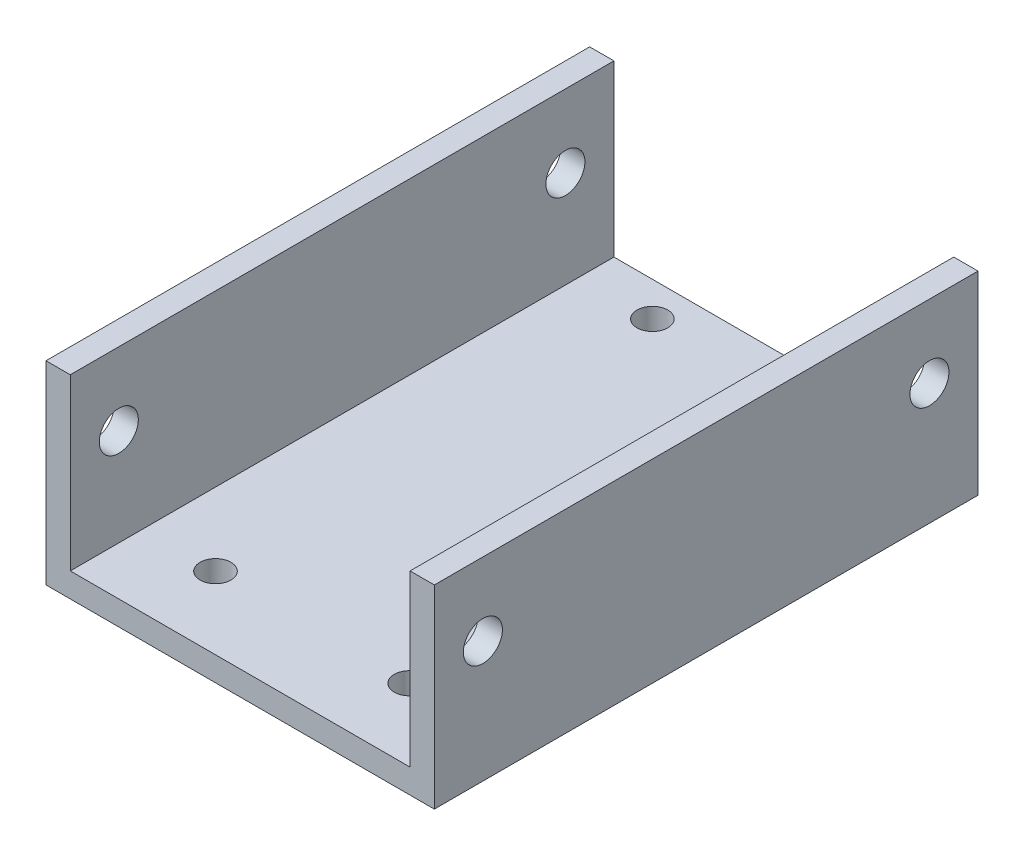
ISO-10303-21;
HEADER;
FILE_DESCRIPTION(('STEP AP214'),'2;1');
FILE_NAME('part.step','',(''),(''),'','','');
FILE_SCHEMA(('AUTOMOTIVE_DESIGN { 1 0 10303 214 1 1 1 1 }'));
ENDSEC;
DATA;
#1=APPLICATION_CONTEXT('core data for automotive mechanical design processes');
#2=APPLICATION_PROTOCOL_DEFINITION('international standard','automotive_design',2000,#1);
#3=PRODUCT_CONTEXT('',#1,'mechanical');
#4=PRODUCT('Part','Part','',(#3));
#5=PRODUCT_RELATED_PRODUCT_CATEGORY('part','',(#4));
#6=PRODUCT_DEFINITION_FORMATION('','',#4);
#7=PRODUCT_DEFINITION_CONTEXT('part definition',#1,'design');
#8=PRODUCT_DEFINITION('design','',#6,#7);
#9=PRODUCT_DEFINITION_SHAPE('','',#8);
#10=(LENGTH_UNIT() NAMED_UNIT(*) SI_UNIT(.MILLI.,.METRE.));
#11=(NAMED_UNIT(*) PLANE_ANGLE_UNIT() SI_UNIT($,.RADIAN.));
#12=(NAMED_UNIT(*) SI_UNIT($,.STERADIAN.) SOLID_ANGLE_UNIT());
#13=UNCERTAINTY_MEASURE_WITH_UNIT(LENGTH_MEASURE(1.E-05),#10,'distance_accuracy_value','');
#14=(GEOMETRIC_REPRESENTATION_CONTEXT(3) GLOBAL_UNCERTAINTY_ASSIGNED_CONTEXT((#13)) GLOBAL_UNIT_ASSIGNED_CONTEXT((#10,
#11,#12)) REPRESENTATION_CONTEXT('',''));
#15=CARTESIAN_POINT('',(0.,0.,0.));
#16=DIRECTION('',(0.,0.,1.));
#17=DIRECTION('',(1.,0.,0.));
#18=AXIS2_PLACEMENT_3D('',#15,#16,#17);
#19=CARTESIAN_POINT('',(0.,0.,71.12));
#20=DIRECTION('',(1.,0.,0.));
#21=DIRECTION('',(0.,0.,-1.));
#22=AXIS2_PLACEMENT_3D('',#19,#20,#21);
#23=PLANE('',#22);
#24=CARTESIAN_POINT('',(0.,15.8750000000002,6.35000000000003));
#25=DIRECTION('',(1.,0.,0.));
#26=DIRECTION('',(0.,0.,-1.));
#27=AXIS2_PLACEMENT_3D('',#24,#25,#26);
#28=CIRCLE('',#27,2.5527);
#29=CARTESIAN_POINT('',(0.,15.8750000000002,3.79730000000003));
#30=VERTEX_POINT('',#29);
#31=EDGE_CURVE('E165',#30,#30,#28,.T.);
#32=ORIENTED_EDGE('',*,*,#31,.T.);
#33=EDGE_LOOP('',(#32));
#34=FACE_BOUND('',#33,.T.);
#35=CARTESIAN_POINT('',(0.,15.8750000000001,64.77));
#36=DIRECTION('',(1.,0.,0.));
#37=DIRECTION('',(0.,0.,-1.));
#38=AXIS2_PLACEMENT_3D('',#35,#36,#37);
#39=CIRCLE('',#38,2.55270000000001);
#40=CARTESIAN_POINT('',(0.,15.8750000000001,62.2173));
#41=VERTEX_POINT('',#40);
#42=EDGE_CURVE('E176',#41,#41,#39,.T.);
#43=ORIENTED_EDGE('',*,*,#42,.T.);
#44=EDGE_LOOP('',(#43));
#45=FACE_BOUND('',#44,.T.);
#46=DIRECTION('',(0.,-1.,0.));
#47=VECTOR('',#46,1.);
#48=CARTESIAN_POINT('',(0.,0.,0.));
#49=LINE('',#48,#47);
#50=CARTESIAN_POINT('',(0.,25.4,0.));
#51=VERTEX_POINT('',#50);
#52=CARTESIAN_POINT('',(0.,0.,0.));
#53=VERTEX_POINT('',#52);
#54=EDGE_CURVE('E136',#51,#53,#49,.T.);
#55=ORIENTED_EDGE('',*,*,#54,.T.);
#56=DIRECTION('',(0.,0.,-1.));
#57=VECTOR('',#56,1.);
#58=CARTESIAN_POINT('',(0.,0.,71.12));
#59=LINE('',#58,#57);
#60=CARTESIAN_POINT('',(0.,0.,71.12));
#61=VERTEX_POINT('',#60);
#62=EDGE_CURVE('E11',#61,#53,#59,.T.);
#63=ORIENTED_EDGE('',*,*,#62,.F.);
#64=DIRECTION('',(0.,-1.,0.));
#65=VECTOR('',#64,1.);
#66=CARTESIAN_POINT('',(0.,0.,71.12));
#67=LINE('',#66,#65);
#68=CARTESIAN_POINT('',(0.,25.4,71.12));
#69=VERTEX_POINT('',#68);
#70=EDGE_CURVE('E151',#69,#61,#67,.T.);
#71=ORIENTED_EDGE('',*,*,#70,.F.);
#72=DIRECTION('',(0.,0.,-1.));
#73=VECTOR('',#72,1.);
#74=CARTESIAN_POINT('',(0.,25.4,71.12));
#75=LINE('',#74,#73);
#76=EDGE_CURVE('E132',#69,#51,#75,.T.);
#77=ORIENTED_EDGE('',*,*,#76,.T.);
#78=EDGE_LOOP('',(#55,#63,#71,#77));
#79=FACE_BOUND('',#78,.T.);
#80=ADVANCED_FACE('F38',(#34,#45,#79),#23,.F.);
#81=CARTESIAN_POINT('',(0.,0.,71.12));
#82=DIRECTION('',(0.,1.,0.));
#83=DIRECTION('',(0.,0.,1.));
#84=AXIS2_PLACEMENT_3D('',#81,#82,#83);
#85=PLANE('',#84);
#86=CARTESIAN_POINT('',(38.1,0.,61.6475));
#87=DIRECTION('',(0.,1.,0.));
#88=DIRECTION('',(0.,0.,1.));
#89=AXIS2_PLACEMENT_3D('',#86,#87,#88);
#90=CIRCLE('',#89,2.01929999999999);
#91=CARTESIAN_POINT('',(38.1,0.,63.6668));
#92=VERTEX_POINT('',#91);
#93=EDGE_CURVE('E197',#92,#92,#90,.F.);
#94=ORIENTED_EDGE('',*,*,#93,.F.);
#95=EDGE_LOOP('',(#94));
#96=FACE_BOUND('',#95,.T.);
#97=CARTESIAN_POINT('',(12.7,0.,4.49749999999999));
#98=DIRECTION('',(0.,1.,0.));
#99=DIRECTION('',(0.,0.,1.));
#100=AXIS2_PLACEMENT_3D('',#97,#98,#99);
#101=CIRCLE('',#100,2.01929999999999);
#102=CARTESIAN_POINT('',(12.7,0.,6.51679999999999));
#103=VERTEX_POINT('',#102);
#104=EDGE_CURVE('E198',#103,#103,#101,.F.);
#105=ORIENTED_EDGE('',*,*,#104,.F.);
#106=EDGE_LOOP('',(#105));
#107=FACE_BOUND('',#106,.T.);
#108=CARTESIAN_POINT('',(12.7,0.,61.6475));
#109=DIRECTION('',(0.,1.,0.));
#110=DIRECTION('',(0.,0.,1.));
#111=AXIS2_PLACEMENT_3D('',#108,#109,#110);
#112=CIRCLE('',#111,2.01929999999999);
#113=CARTESIAN_POINT('',(12.7,0.,63.6668));
#114=VERTEX_POINT('',#113);
#115=EDGE_CURVE('E190',#114,#114,#112,.F.);
#116=ORIENTED_EDGE('',*,*,#115,.F.);
#117=EDGE_LOOP('',(#116));
#118=FACE_BOUND('',#117,.T.);
#119=CARTESIAN_POINT('',(38.1,0.,4.49749999999999));
#120=DIRECTION('',(0.,1.,0.));
#121=DIRECTION('',(0.,0.,1.));
#122=AXIS2_PLACEMENT_3D('',#119,#120,#121);
#123=CIRCLE('',#122,2.0193);
#124=CARTESIAN_POINT('',(38.1,0.,6.51679999999999));
#125=VERTEX_POINT('',#124);
#126=EDGE_CURVE('E140',#125,#125,#123,.F.);
#127=ORIENTED_EDGE('',*,*,#126,.F.);
#128=EDGE_LOOP('',(#127));
#129=FACE_BOUND('',#128,.T.);
#130=DIRECTION('',(1.,0.,0.));
#131=VECTOR('',#130,1.);
#132=CARTESIAN_POINT('',(0.,0.,0.));
#133=LINE('',#132,#131);
#134=CARTESIAN_POINT('',(50.8,0.,0.));
#135=VERTEX_POINT('',#134);
#136=EDGE_CURVE('E139',#53,#135,#133,.T.);
#137=ORIENTED_EDGE('',*,*,#136,.T.);
#138=DIRECTION('',(0.,0.,-1.));
#139=VECTOR('',#138,1.);
#140=CARTESIAN_POINT('',(50.8,0.,71.12));
#141=LINE('',#140,#139);
#142=CARTESIAN_POINT('',(50.8,0.,71.12));
#143=VERTEX_POINT('',#142);
#144=EDGE_CURVE('E47',#143,#135,#141,.T.);
#145=ORIENTED_EDGE('',*,*,#144,.F.);
#146=DIRECTION('',(1.,0.,0.));
#147=VECTOR('',#146,1.);
#148=CARTESIAN_POINT('',(0.,0.,71.12));
#149=LINE('',#148,#147);
#150=EDGE_CURVE('E99',#61,#143,#149,.T.);
#151=ORIENTED_EDGE('',*,*,#150,.F.);
#152=ORIENTED_EDGE('',*,*,#62,.T.);
#153=EDGE_LOOP('',(#137,#145,#151,#152));
#154=FACE_BOUND('',#153,.T.);
#155=ADVANCED_FACE('F244',(#96,#107,#118,#129,#154),#85,.F.);
#156=CARTESIAN_POINT('',(50.8,0.,71.12));
#157=DIRECTION('',(-1.,0.,0.));
#158=DIRECTION('',(0.,0.,1.));
#159=AXIS2_PLACEMENT_3D('',#156,#157,#158);
#160=PLANE('',#159);
#161=CARTESIAN_POINT('',(50.8,15.8750000000002,6.35000000000003));
#162=DIRECTION('',(1.,0.,0.));
#163=DIRECTION('',(0.,0.,-1.));
#164=AXIS2_PLACEMENT_3D('',#161,#162,#163);
#165=CIRCLE('',#164,2.5527);
#166=CARTESIAN_POINT('',(50.8,15.8750000000002,3.79730000000003));
#167=VERTEX_POINT('',#166);
#168=EDGE_CURVE('E171',#167,#167,#165,.T.);
#169=ORIENTED_EDGE('',*,*,#168,.F.);
#170=EDGE_LOOP('',(#169));
#171=FACE_BOUND('',#170,.T.);
#172=CARTESIAN_POINT('',(50.8,15.8750000000001,64.77));
#173=DIRECTION('',(1.,0.,0.));
#174=DIRECTION('',(0.,0.,-1.));
#175=AXIS2_PLACEMENT_3D('',#172,#173,#174);
#176=CIRCLE('',#175,2.55270000000001);
#177=CARTESIAN_POINT('',(50.8,15.8750000000001,62.2173));
#178=VERTEX_POINT('',#177);
#179=EDGE_CURVE('E181',#178,#178,#176,.T.);
#180=ORIENTED_EDGE('',*,*,#179,.F.);
#181=EDGE_LOOP('',(#180));
#182=FACE_BOUND('',#181,.T.);
#183=DIRECTION('',(0.,1.,0.));
#184=VECTOR('',#183,1.);
#185=CARTESIAN_POINT('',(50.8,0.,0.));
#186=LINE('',#185,#184);
#187=CARTESIAN_POINT('',(50.8,25.4,0.));
#188=VERTEX_POINT('',#187);
#189=EDGE_CURVE('E142',#135,#188,#186,.T.);
#190=ORIENTED_EDGE('',*,*,#189,.T.);
#191=DIRECTION('',(0.,0.,-1.));
#192=VECTOR('',#191,1.);
#193=CARTESIAN_POINT('',(50.8,25.4,71.12));
#194=LINE('',#193,#192);
#195=CARTESIAN_POINT('',(50.8,25.4,71.12));
#196=VERTEX_POINT('',#195);
#197=EDGE_CURVE('E158',#196,#188,#194,.T.);
#198=ORIENTED_EDGE('',*,*,#197,.F.);
#199=DIRECTION('',(0.,1.,0.));
#200=VECTOR('',#199,1.);
#201=CARTESIAN_POINT('',(50.8,0.,71.12));
#202=LINE('',#201,#200);
#203=EDGE_CURVE('E212',#143,#196,#202,.T.);
#204=ORIENTED_EDGE('',*,*,#203,.F.);
#205=ORIENTED_EDGE('',*,*,#144,.T.);
#206=EDGE_LOOP('',(#190,#198,#204,#205));
#207=FACE_BOUND('',#206,.T.);
#208=ADVANCED_FACE('F248',(#171,#182,#207),#160,.F.);
#209=CARTESIAN_POINT('',(50.8,25.4,71.12));
#210=DIRECTION('',(0.,-1.,0.));
#211=DIRECTION('',(0.,0.,-1.));
#212=AXIS2_PLACEMENT_3D('',#209,#210,#211);
#213=PLANE('',#212);
#214=DIRECTION('',(-1.,0.,0.));
#215=VECTOR('',#214,1.);
#216=CARTESIAN_POINT('',(50.8,25.4,0.));
#217=LINE('',#216,#215);
#218=CARTESIAN_POINT('',(47.625,25.4,0.));
#219=VERTEX_POINT('',#218);
#220=EDGE_CURVE('E144',#188,#219,#217,.T.);
#221=ORIENTED_EDGE('',*,*,#220,.T.);
#222=DIRECTION('',(0.,0.,-1.));
#223=VECTOR('',#222,1.);
#224=CARTESIAN_POINT('',(47.625,25.4,71.12));
#225=LINE('',#224,#223);
#226=CARTESIAN_POINT('',(47.625,25.4,71.12));
#227=VERTEX_POINT('',#226);
#228=EDGE_CURVE('E155',#227,#219,#225,.T.);
#229=ORIENTED_EDGE('',*,*,#228,.F.);
#230=DIRECTION('',(-1.,0.,0.));
#231=VECTOR('',#230,1.);
#232=CARTESIAN_POINT('',(50.8,25.4,71.12));
#233=LINE('',#232,#231);
#234=EDGE_CURVE('E214',#196,#227,#233,.T.);
#235=ORIENTED_EDGE('',*,*,#234,.F.);
#236=ORIENTED_EDGE('',*,*,#197,.T.);
#237=EDGE_LOOP('',(#221,#229,#235,#236));
#238=FACE_BOUND('',#237,.T.);
#239=ADVANCED_FACE('F220',(#238),#213,.F.);
#240=CARTESIAN_POINT('',(47.625,3.175,71.12));
#241=DIRECTION('',(1.,0.,0.));
#242=DIRECTION('',(0.,0.,-1.));
#243=AXIS2_PLACEMENT_3D('',#240,#241,#242);
#244=PLANE('',#243);
#245=CARTESIAN_POINT('',(47.625,15.8750000000002,6.35000000000003));
#246=DIRECTION('',(1.,0.,0.));
#247=DIRECTION('',(0.,0.,-1.));
#248=AXIS2_PLACEMENT_3D('',#245,#246,#247);
#249=CIRCLE('',#248,2.5527);
#250=CARTESIAN_POINT('',(47.625,15.8750000000002,3.79730000000003));
#251=VERTEX_POINT('',#250);
#252=EDGE_CURVE('E184',#251,#251,#249,.T.);
#253=ORIENTED_EDGE('',*,*,#252,.T.);
#254=EDGE_LOOP('',(#253));
#255=FACE_BOUND('',#254,.T.);
#256=CARTESIAN_POINT('',(47.625,15.8750000000001,64.77));
#257=DIRECTION('',(1.,0.,0.));
#258=DIRECTION('',(0.,0.,-1.));
#259=AXIS2_PLACEMENT_3D('',#256,#257,#258);
#260=CIRCLE('',#259,2.55270000000001);
#261=CARTESIAN_POINT('',(47.625,15.8750000000001,62.2173));
#262=VERTEX_POINT('',#261);
#263=EDGE_CURVE('E164',#262,#262,#260,.T.);
#264=ORIENTED_EDGE('',*,*,#263,.T.);
#265=EDGE_LOOP('',(#264));
#266=FACE_BOUND('',#265,.T.);
#267=DIRECTION('',(0.,-1.,0.));
#268=VECTOR('',#267,1.);
#269=CARTESIAN_POINT('',(47.625,3.175,0.));
#270=LINE('',#269,#268);
#271=CARTESIAN_POINT('',(47.625,3.175,0.));
#272=VERTEX_POINT('',#271);
#273=EDGE_CURVE('E146',#219,#272,#270,.T.);
#274=ORIENTED_EDGE('',*,*,#273,.T.);
#275=DIRECTION('',(0.,0.,-1.));
#276=VECTOR('',#275,1.);
#277=CARTESIAN_POINT('',(47.625,3.175,71.12));
#278=LINE('',#277,#276);
#279=CARTESIAN_POINT('',(47.625,3.175,71.12));
#280=VERTEX_POINT('',#279);
#281=EDGE_CURVE('E127',#280,#272,#278,.T.);
#282=ORIENTED_EDGE('',*,*,#281,.F.);
#283=DIRECTION('',(0.,-1.,0.));
#284=VECTOR('',#283,1.);
#285=CARTESIAN_POINT('',(47.625,3.175,71.12));
#286=LINE('',#285,#284);
#287=EDGE_CURVE('E118',#227,#280,#286,.T.);
#288=ORIENTED_EDGE('',*,*,#287,.F.);
#289=ORIENTED_EDGE('',*,*,#228,.T.);
#290=EDGE_LOOP('',(#274,#282,#288,#289));
#291=FACE_BOUND('',#290,.T.);
#292=ADVANCED_FACE('F224',(#255,#266,#291),#244,.F.);
#293=CARTESIAN_POINT('',(3.175,3.175,71.12));
#294=DIRECTION('',(0.,-1.,0.));
#295=DIRECTION('',(0.,0.,-1.));
#296=AXIS2_PLACEMENT_3D('',#293,#294,#295);
#297=PLANE('',#296);
#298=CARTESIAN_POINT('',(38.1,3.175,61.6475));
#299=DIRECTION('',(0.,1.,0.));
#300=DIRECTION('',(0.,0.,1.));
#301=AXIS2_PLACEMENT_3D('',#298,#299,#300);
#302=CIRCLE('',#301,2.01929999999999);
#303=CARTESIAN_POINT('',(38.1,3.175,63.6668));
#304=VERTEX_POINT('',#303);
#305=EDGE_CURVE('E194',#304,#304,#302,.T.);
#306=ORIENTED_EDGE('',*,*,#305,.F.);
#307=EDGE_LOOP('',(#306));
#308=FACE_BOUND('',#307,.T.);
#309=CARTESIAN_POINT('',(12.7,3.175,4.49749999999999));
#310=DIRECTION('',(0.,1.,0.));
#311=DIRECTION('',(0.,0.,1.));
#312=AXIS2_PLACEMENT_3D('',#309,#310,#311);
#313=CIRCLE('',#312,2.01929999999999);
#314=CARTESIAN_POINT('',(12.7,3.175,6.51679999999999));
#315=VERTEX_POINT('',#314);
#316=EDGE_CURVE('E193',#315,#315,#313,.T.);
#317=ORIENTED_EDGE('',*,*,#316,.F.);
#318=EDGE_LOOP('',(#317));
#319=FACE_BOUND('',#318,.T.);
#320=CARTESIAN_POINT('',(12.7,3.175,61.6475));
#321=DIRECTION('',(0.,1.,0.));
#322=DIRECTION('',(0.,0.,1.));
#323=AXIS2_PLACEMENT_3D('',#320,#321,#322);
#324=CIRCLE('',#323,2.01929999999999);
#325=CARTESIAN_POINT('',(12.7,3.175,63.6668));
#326=VERTEX_POINT('',#325);
#327=EDGE_CURVE('E187',#326,#326,#324,.T.);
#328=ORIENTED_EDGE('',*,*,#327,.F.);
#329=EDGE_LOOP('',(#328));
#330=FACE_BOUND('',#329,.T.);
#331=CARTESIAN_POINT('',(38.1,3.175,4.49749999999999));
#332=DIRECTION('',(0.,1.,0.));
#333=DIRECTION('',(0.,0.,1.));
#334=AXIS2_PLACEMENT_3D('',#331,#332,#333);
#335=CIRCLE('',#334,2.0193);
#336=CARTESIAN_POINT('',(38.1,3.175,6.51679999999999));
#337=VERTEX_POINT('',#336);
#338=EDGE_CURVE('E201',#337,#337,#335,.T.);
#339=ORIENTED_EDGE('',*,*,#338,.F.);
#340=EDGE_LOOP('',(#339));
#341=FACE_BOUND('',#340,.T.);
#342=DIRECTION('',(-1.,0.,0.));
#343=VECTOR('',#342,1.);
#344=CARTESIAN_POINT('',(3.175,3.175,0.));
#345=LINE('',#344,#343);
#346=CARTESIAN_POINT('',(3.175,3.175,0.));
#347=VERTEX_POINT('',#346);
#348=EDGE_CURVE('E126',#272,#347,#345,.T.);
#349=ORIENTED_EDGE('',*,*,#348,.T.);
#350=DIRECTION('',(0.,0.,-1.));
#351=VECTOR('',#350,1.);
#352=CARTESIAN_POINT('',(3.175,3.175,71.12));
#353=LINE('',#352,#351);
#354=CARTESIAN_POINT('',(3.175,3.175,71.12));
#355=VERTEX_POINT('',#354);
#356=EDGE_CURVE('E123',#355,#347,#353,.T.);
#357=ORIENTED_EDGE('',*,*,#356,.F.);
#358=DIRECTION('',(-1.,0.,0.));
#359=VECTOR('',#358,1.);
#360=CARTESIAN_POINT('',(3.175,3.175,71.12));
#361=LINE('',#360,#359);
#362=EDGE_CURVE('E112',#280,#355,#361,.T.);
#363=ORIENTED_EDGE('',*,*,#362,.F.);
#364=ORIENTED_EDGE('',*,*,#281,.T.);
#365=EDGE_LOOP('',(#349,#357,#363,#364));
#366=FACE_BOUND('',#365,.T.);
#367=ADVANCED_FACE('F124',(#308,#319,#330,#341,#366),#297,.F.);
#368=CARTESIAN_POINT('',(3.175,3.175,71.12));
#369=DIRECTION('',(-1.,0.,0.));
#370=DIRECTION('',(0.,0.,1.));
#371=AXIS2_PLACEMENT_3D('',#368,#369,#370);
#372=PLANE('',#371);
#373=CARTESIAN_POINT('',(3.175,15.8750000000002,6.35000000000003));
#374=DIRECTION('',(-1.,0.,0.));
#375=DIRECTION('',(0.,0.,1.));
#376=AXIS2_PLACEMENT_3D('',#373,#374,#375);
#377=CIRCLE('',#376,2.5527);
#378=CARTESIAN_POINT('',(3.175,15.8750000000002,8.90270000000003));
#379=VERTEX_POINT('',#378);
#380=EDGE_CURVE('E41',#379,#379,#377,.T.);
#381=ORIENTED_EDGE('',*,*,#380,.T.);
#382=EDGE_LOOP('',(#381));
#383=FACE_BOUND('',#382,.T.);
#384=CARTESIAN_POINT('',(3.175,15.8750000000001,64.77));
#385=DIRECTION('',(-1.,0.,0.));
#386=DIRECTION('',(0.,0.,1.));
#387=AXIS2_PLACEMENT_3D('',#384,#385,#386);
#388=CIRCLE('',#387,2.55270000000001);
#389=CARTESIAN_POINT('',(3.175,15.8750000000001,67.3227));
#390=VERTEX_POINT('',#389);
#391=EDGE_CURVE('E162',#390,#390,#388,.T.);
#392=ORIENTED_EDGE('',*,*,#391,.T.);
#393=EDGE_LOOP('',(#392));
#394=FACE_BOUND('',#393,.T.);
#395=DIRECTION('',(0.,1.,0.));
#396=VECTOR('',#395,1.);
#397=CARTESIAN_POINT('',(3.175,3.175,0.));
#398=LINE('',#397,#396);
#399=CARTESIAN_POINT('',(3.175,25.4,0.));
#400=VERTEX_POINT('',#399);
#401=EDGE_CURVE('E85',#347,#400,#398,.T.);
#402=ORIENTED_EDGE('',*,*,#401,.T.);
#403=DIRECTION('',(0.,0.,-1.));
#404=VECTOR('',#403,1.);
#405=CARTESIAN_POINT('',(3.175,25.4,71.12));
#406=LINE('',#405,#404);
#407=CARTESIAN_POINT('',(3.175,25.4,71.12));
#408=VERTEX_POINT('',#407);
#409=EDGE_CURVE('E128',#408,#400,#406,.T.);
#410=ORIENTED_EDGE('',*,*,#409,.F.);
#411=DIRECTION('',(0.,1.,0.));
#412=VECTOR('',#411,1.);
#413=CARTESIAN_POINT('',(3.175,3.175,71.12));
#414=LINE('',#413,#412);
#415=EDGE_CURVE('E116',#355,#408,#414,.T.);
#416=ORIENTED_EDGE('',*,*,#415,.F.);
#417=ORIENTED_EDGE('',*,*,#356,.T.);
#418=EDGE_LOOP('',(#402,#410,#416,#417));
#419=FACE_BOUND('',#418,.T.);
#420=ADVANCED_FACE('F130',(#383,#394,#419),#372,.F.);
#421=CARTESIAN_POINT('',(0.,25.4,71.12));
#422=DIRECTION('',(0.,-1.,0.));
#423=DIRECTION('',(0.,0.,-1.));
#424=AXIS2_PLACEMENT_3D('',#421,#422,#423);
#425=PLANE('',#424);
#426=DIRECTION('',(-1.,0.,0.));
#427=VECTOR('',#426,1.);
#428=CARTESIAN_POINT('',(0.,25.4,0.));
#429=LINE('',#428,#427);
#430=EDGE_CURVE('E91',#400,#51,#429,.T.);
#431=ORIENTED_EDGE('',*,*,#430,.T.);
#432=ORIENTED_EDGE('',*,*,#76,.F.);
#433=DIRECTION('',(-1.,0.,0.));
#434=VECTOR('',#433,1.);
#435=CARTESIAN_POINT('',(0.,25.4,71.12));
#436=LINE('',#435,#434);
#437=EDGE_CURVE('E56',#408,#69,#436,.T.);
#438=ORIENTED_EDGE('',*,*,#437,.F.);
#439=ORIENTED_EDGE('',*,*,#409,.T.);
#440=EDGE_LOOP('',(#431,#432,#438,#439));
#441=FACE_BOUND('',#440,.T.);
#442=ADVANCED_FACE('F232',(#441),#425,.F.);
#443=CARTESIAN_POINT('',(0.,0.,71.12));
#444=DIRECTION('',(0.,0.,-1.));
#445=DIRECTION('',(-1.,0.,0.));
#446=AXIS2_PLACEMENT_3D('',#443,#444,#445);
#447=PLANE('',#446);
#448=ORIENTED_EDGE('',*,*,#70,.T.);
#449=ORIENTED_EDGE('',*,*,#150,.T.);
#450=ORIENTED_EDGE('',*,*,#203,.T.);
#451=ORIENTED_EDGE('',*,*,#234,.T.);
#452=ORIENTED_EDGE('',*,*,#287,.T.);
#453=ORIENTED_EDGE('',*,*,#362,.T.);
#454=ORIENTED_EDGE('',*,*,#415,.T.);
#455=ORIENTED_EDGE('',*,*,#437,.T.);
#456=EDGE_LOOP('',(#448,#449,#450,#451,#452,#453,#454,#455));
#457=FACE_BOUND('',#456,.T.);
#458=ADVANCED_FACE('F114',(#457),#447,.F.);
#459=CARTESIAN_POINT('',(0.,0.,0.));
#460=DIRECTION('',(0.,0.,-1.));
#461=DIRECTION('',(-1.,0.,0.));
#462=AXIS2_PLACEMENT_3D('',#459,#460,#461);
#463=PLANE('',#462);
#464=ORIENTED_EDGE('',*,*,#54,.F.);
#465=ORIENTED_EDGE('',*,*,#430,.F.);
#466=ORIENTED_EDGE('',*,*,#401,.F.);
#467=ORIENTED_EDGE('',*,*,#348,.F.);
#468=ORIENTED_EDGE('',*,*,#273,.F.);
#469=ORIENTED_EDGE('',*,*,#220,.F.);
#470=ORIENTED_EDGE('',*,*,#189,.F.);
#471=ORIENTED_EDGE('',*,*,#136,.F.);
#472=EDGE_LOOP('',(#464,#465,#466,#467,#468,#469,#470,#471));
#473=FACE_BOUND('',#472,.T.);
#474=ADVANCED_FACE('F227',(#473),#463,.T.);
#475=CARTESIAN_POINT('',(38.1,-0.00100000000000013,4.49749999999999));
#476=DIRECTION('',(0.,1.,0.));
#477=DIRECTION('',(0.,0.,1.));
#478=AXIS2_PLACEMENT_3D('',#475,#476,#477);
#479=CYLINDRICAL_SURFACE('',#478,2.0193);
#480=ORIENTED_EDGE('',*,*,#338,.T.);
#481=EDGE_LOOP('',(#480));
#482=FACE_BOUND('',#481,.T.);
#483=ORIENTED_EDGE('',*,*,#126,.T.);
#484=EDGE_LOOP('',(#483));
#485=FACE_BOUND('',#484,.T.);
#486=ADVANCED_FACE('F327',(#482,#485),#479,.F.);
#487=CARTESIAN_POINT('',(12.7,-0.00100000000000013,61.6475));
#488=DIRECTION('',(0.,1.,0.));
#489=DIRECTION('',(0.,0.,1.));
#490=AXIS2_PLACEMENT_3D('',#487,#488,#489);
#491=CYLINDRICAL_SURFACE('',#490,2.01929999999999);
#492=ORIENTED_EDGE('',*,*,#327,.T.);
#493=EDGE_LOOP('',(#492));
#494=FACE_BOUND('',#493,.T.);
#495=ORIENTED_EDGE('',*,*,#115,.T.);
#496=EDGE_LOOP('',(#495));
#497=FACE_BOUND('',#496,.T.);
#498=ADVANCED_FACE('F347',(#494,#497),#491,.F.);
#499=CARTESIAN_POINT('',(12.7,-0.00100000000000013,4.49749999999999));
#500=DIRECTION('',(0.,1.,0.));
#501=DIRECTION('',(0.,0.,1.));
#502=AXIS2_PLACEMENT_3D('',#499,#500,#501);
#503=CYLINDRICAL_SURFACE('',#502,2.01929999999999);
#504=ORIENTED_EDGE('',*,*,#316,.T.);
#505=EDGE_LOOP('',(#504));
#506=FACE_BOUND('',#505,.T.);
#507=ORIENTED_EDGE('',*,*,#104,.T.);
#508=EDGE_LOOP('',(#507));
#509=FACE_BOUND('',#508,.T.);
#510=ADVANCED_FACE('F267',(#506,#509),#503,.F.);
#511=CARTESIAN_POINT('',(38.1,-0.00100000000000013,61.6475));
#512=DIRECTION('',(0.,1.,0.));
#513=DIRECTION('',(0.,0.,1.));
#514=AXIS2_PLACEMENT_3D('',#511,#512,#513);
#515=CYLINDRICAL_SURFACE('',#514,2.01929999999999);
#516=ORIENTED_EDGE('',*,*,#305,.T.);
#517=EDGE_LOOP('',(#516));
#518=FACE_BOUND('',#517,.T.);
#519=ORIENTED_EDGE('',*,*,#93,.T.);
#520=EDGE_LOOP('',(#519));
#521=FACE_BOUND('',#520,.T.);
#522=ADVANCED_FACE('F257',(#518,#521),#515,.F.);
#523=CARTESIAN_POINT('',(0.,15.8750000000001,64.77));
#524=DIRECTION('',(1.,0.,0.));
#525=DIRECTION('',(0.,0.,-1.));
#526=AXIS2_PLACEMENT_3D('',#523,#524,#525);
#527=CYLINDRICAL_SURFACE('',#526,2.55270000000001);
#528=ORIENTED_EDGE('',*,*,#42,.F.);
#529=EDGE_LOOP('',(#528));
#530=FACE_BOUND('',#529,.T.);
#531=ORIENTED_EDGE('',*,*,#391,.F.);
#532=EDGE_LOOP('',(#531));
#533=FACE_BOUND('',#532,.T.);
#534=ADVANCED_FACE('F253',(#530,#533),#527,.F.);
#535=CARTESIAN_POINT('',(0.,15.8750000000002,6.35000000000003));
#536=DIRECTION('',(1.,0.,0.));
#537=DIRECTION('',(0.,0.,-1.));
#538=AXIS2_PLACEMENT_3D('',#535,#536,#537);
#539=CYLINDRICAL_SURFACE('',#538,2.5527);
#540=ORIENTED_EDGE('',*,*,#31,.F.);
#541=EDGE_LOOP('',(#540));
#542=FACE_BOUND('',#541,.T.);
#543=ORIENTED_EDGE('',*,*,#380,.F.);
#544=EDGE_LOOP('',(#543));
#545=FACE_BOUND('',#544,.T.);
#546=ADVANCED_FACE('F256',(#542,#545),#539,.F.);
#547=ORIENTED_EDGE('',*,*,#179,.T.);
#548=EDGE_LOOP('',(#547));
#549=FACE_BOUND('',#548,.T.);
#550=ORIENTED_EDGE('',*,*,#263,.F.);
#551=EDGE_LOOP('',(#550));
#552=FACE_BOUND('',#551,.T.);
#553=ADVANCED_FACE('F259',(#549,#552),#527,.F.);
#554=ORIENTED_EDGE('',*,*,#168,.T.);
#555=EDGE_LOOP('',(#554));
#556=FACE_BOUND('',#555,.T.);
#557=ORIENTED_EDGE('',*,*,#252,.F.);
#558=EDGE_LOOP('',(#557));
#559=FACE_BOUND('',#558,.T.);
#560=ADVANCED_FACE('F266',(#556,#559),#539,.F.);
#561=CLOSED_SHELL('',(#80,#155,#208,#239,#292,#367,#420,#442,#458,#474,#486,#498,#510,#522,#534,
#546,#553,#560));
#562=MANIFOLD_SOLID_BREP('B2',#561);
#563=ADVANCED_BREP_SHAPE_REPRESENTATION('',(#18,#562),#14);
#564=SHAPE_DEFINITION_REPRESENTATION(#9,#563);
ENDSEC;
END-ISO-10303-21;
